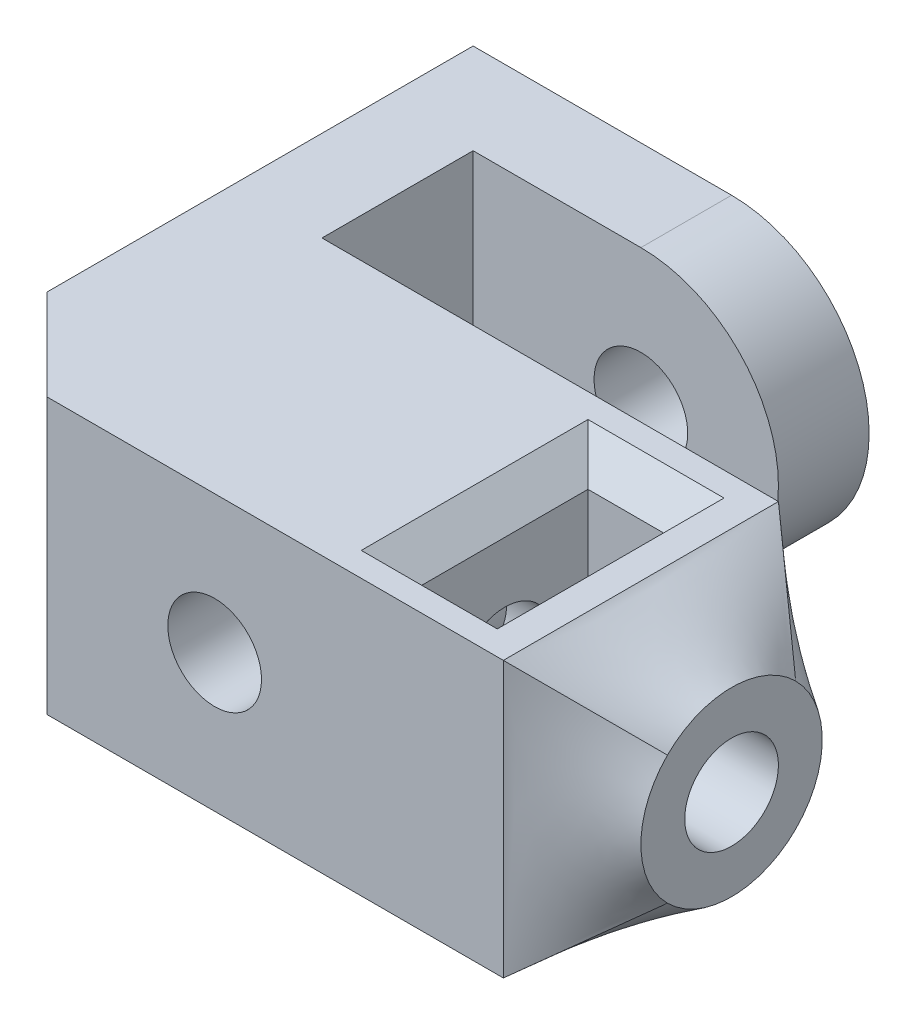
ISO-10303-21;
HEADER;
FILE_DESCRIPTION(('STEP AP214'),'2;1');
FILE_NAME('part.step','',(''),(''),'','','');
FILE_SCHEMA(('AUTOMOTIVE_DESIGN { 1 0 10303 214 1 1 1 1 }'));
ENDSEC;
DATA;
#1=APPLICATION_CONTEXT('core data for automotive mechanical design processes');
#2=APPLICATION_PROTOCOL_DEFINITION('international standard','automotive_design',2000,#1);
#3=PRODUCT_CONTEXT('',#1,'mechanical');
#4=PRODUCT('Part','Part','',(#3));
#5=PRODUCT_RELATED_PRODUCT_CATEGORY('part','',(#4));
#6=PRODUCT_DEFINITION_FORMATION('','',#4);
#7=PRODUCT_DEFINITION_CONTEXT('part definition',#1,'design');
#8=PRODUCT_DEFINITION('design','',#6,#7);
#9=PRODUCT_DEFINITION_SHAPE('','',#8);
#10=(LENGTH_UNIT() NAMED_UNIT(*) SI_UNIT(.MILLI.,.METRE.));
#11=(NAMED_UNIT(*) PLANE_ANGLE_UNIT() SI_UNIT($,.RADIAN.));
#12=(NAMED_UNIT(*) SI_UNIT($,.STERADIAN.) SOLID_ANGLE_UNIT());
#13=UNCERTAINTY_MEASURE_WITH_UNIT(LENGTH_MEASURE(1.E-05),#10,'distance_accuracy_value','');
#14=(GEOMETRIC_REPRESENTATION_CONTEXT(3) GLOBAL_UNCERTAINTY_ASSIGNED_CONTEXT((#13)) GLOBAL_UNIT_ASSIGNED_CONTEXT((#10,
#11,#12)) REPRESENTATION_CONTEXT('',''));
#15=CARTESIAN_POINT('',(0.,0.,0.));
#16=DIRECTION('',(0.,0.,1.));
#17=DIRECTION('',(1.,0.,0.));
#18=AXIS2_PLACEMENT_3D('',#15,#16,#17);
#19=CARTESIAN_POINT('',(-107.11518965689,2.50000000001586,4.55));
#20=DIRECTION('',(1.,0.,0.));
#21=DIRECTION('',(0.,0.,-1.));
#22=AXIS2_PLACEMENT_3D('',#19,#20,#21);
#23=CYLINDRICAL_SURFACE('',#22,1.55);
#24=CARTESIAN_POINT('',(-82.0141896568897,2.50000000001586,4.55));
#25=DIRECTION('',(1.,0.,0.));
#26=DIRECTION('',(0.,0.,-1.));
#27=AXIS2_PLACEMENT_3D('',#24,#25,#26);
#28=CIRCLE('',#27,1.55);
#29=CARTESIAN_POINT('',(-82.0141896568897,2.50000000001586,3.));
#30=VERTEX_POINT('',#29);
#31=EDGE_CURVE('E213',#30,#30,#28,.T.);
#32=ORIENTED_EDGE('',*,*,#31,.T.);
#33=EDGE_LOOP('',(#32));
#34=FACE_BOUND('',#33,.T.);
#35=CARTESIAN_POINT('',(-87.0141896568897,2.50000000001586,4.55));
#36=DIRECTION('',(-1.,0.,0.));
#37=DIRECTION('',(0.,0.,1.));
#38=AXIS2_PLACEMENT_3D('',#35,#36,#37);
#39=CIRCLE('',#38,1.55);
#40=CARTESIAN_POINT('',(-87.0141896568897,2.50000000001586,6.1));
#41=VERTEX_POINT('',#40);
#42=EDGE_CURVE('E290',#41,#41,#39,.T.);
#43=ORIENTED_EDGE('',*,*,#42,.T.);
#44=EDGE_LOOP('',(#43));
#45=FACE_BOUND('',#44,.T.);
#46=ADVANCED_FACE('F65',(#34,#45),#23,.F.);
#47=CARTESIAN_POINT('',(-100.11418965689,0.,0.));
#48=DIRECTION('',(-1.,0.,0.));
#49=DIRECTION('',(0.,0.,1.));
#50=AXIS2_PLACEMENT_3D('',#47,#48,#49);
#51=PLANE('',#50);
#52=DIRECTION('',(0.,1.,0.));
#53=VECTOR('',#52,1.);
#54=CARTESIAN_POINT('',(-100.11418965689,0.,-5.));
#55=LINE('',#54,#53);
#56=CARTESIAN_POINT('',(-100.11418965689,-2.04999999998414,-5.));
#57=VERTEX_POINT('',#56);
#58=CARTESIAN_POINT('',(-100.11418965689,7.05000000001586,-5.));
#59=VERTEX_POINT('',#58);
#60=EDGE_CURVE('E591',#57,#59,#55,.T.);
#61=ORIENTED_EDGE('',*,*,#60,.T.);
#62=DIRECTION('',(0.,0.,-1.));
#63=VECTOR('',#62,1.);
#64=CARTESIAN_POINT('',(-100.11418965689,7.05000000001586,-8.));
#65=LINE('',#64,#63);
#66=CARTESIAN_POINT('',(-100.11418965689,7.05000000001586,0.));
#67=VERTEX_POINT('',#66);
#68=EDGE_CURVE('E357',#67,#59,#65,.T.);
#69=ORIENTED_EDGE('',*,*,#68,.F.);
#70=DIRECTION('',(0.,-1.,0.));
#71=VECTOR('',#70,1.);
#72=CARTESIAN_POINT('',(-100.11418965689,0.,0.));
#73=LINE('',#72,#71);
#74=CARTESIAN_POINT('',(-100.11418965689,-2.04999999998414,0.));
#75=VERTEX_POINT('',#74);
#76=EDGE_CURVE('E545',#67,#75,#73,.T.);
#77=ORIENTED_EDGE('',*,*,#76,.T.);
#78=DIRECTION('',(0.,0.,1.));
#79=VECTOR('',#78,1.);
#80=CARTESIAN_POINT('',(-100.11418965689,-2.04999999998414,-8.));
#81=LINE('',#80,#79);
#82=EDGE_CURVE('E354',#57,#75,#81,.T.);
#83=ORIENTED_EDGE('',*,*,#82,.F.);
#84=EDGE_LOOP('',(#61,#69,#77,#83));
#85=FACE_BOUND('',#84,.T.);
#86=ADVANCED_FACE('F262',(#85),#51,.F.);
#87=CARTESIAN_POINT('',(0.,7.05000000001583,9.1));
#88=DIRECTION('',(0.,1.,0.));
#89=DIRECTION('',(-1.,0.,0.));
#90=AXIS2_PLACEMENT_3D('',#87,#88,#89);
#91=PLANE('',#90);
#92=DIRECTION('',(0.,0.,-1.));
#93=VECTOR('',#92,1.);
#94=CARTESIAN_POINT('',(-90.5141896568897,7.05000000001586,1.79999999999998));
#95=LINE('',#94,#93);
#96=CARTESIAN_POINT('',(-90.5141896568897,7.05000000001586,8.30000000000002));
#97=VERTEX_POINT('',#96);
#98=CARTESIAN_POINT('',(-90.5141896568897,7.05000000001586,0.799999999999976));
#99=VERTEX_POINT('',#98);
#100=EDGE_CURVE('E369',#97,#99,#95,.T.);
#101=ORIENTED_EDGE('',*,*,#100,.T.);
#102=DIRECTION('',(1.,0.,0.));
#103=VECTOR('',#102,1.);
#104=CARTESIAN_POINT('',(0.,7.05000000001583,0.799999999999976));
#105=LINE('',#104,#103);
#106=CARTESIAN_POINT('',(-86.0141896568897,7.05000000001586,0.799999999999976));
#107=VERTEX_POINT('',#106);
#108=EDGE_CURVE('E314',#99,#107,#105,.T.);
#109=ORIENTED_EDGE('',*,*,#108,.T.);
#110=DIRECTION('',(0.,0.,1.));
#111=VECTOR('',#110,1.);
#112=CARTESIAN_POINT('',(-86.0141896568897,7.05000000001586,9.1));
#113=LINE('',#112,#111);
#114=CARTESIAN_POINT('',(-86.0141896568897,7.05000000001586,8.30000000000002));
#115=VERTEX_POINT('',#114);
#116=EDGE_CURVE('E382',#107,#115,#113,.T.);
#117=ORIENTED_EDGE('',*,*,#116,.T.);
#118=DIRECTION('',(-1.,0.,0.));
#119=VECTOR('',#118,1.);
#120=CARTESIAN_POINT('',(0.,7.05000000001583,8.30000000000002));
#121=LINE('',#120,#119);
#122=EDGE_CURVE('E380',#115,#97,#121,.T.);
#123=ORIENTED_EDGE('',*,*,#122,.T.);
#124=EDGE_LOOP('',(#101,#109,#117,#123));
#125=FACE_BOUND('',#124,.T.);
#126=DIRECTION('',(0.,0.,-1.));
#127=VECTOR('',#126,1.);
#128=CARTESIAN_POINT('',(-103.11418965689,7.05000000001586,-8.));
#129=LINE('',#128,#127);
#130=CARTESIAN_POINT('',(-103.11418965689,7.05000000001586,6.09999999999998));
#131=VERTEX_POINT('',#130);
#132=CARTESIAN_POINT('',(-103.11418965689,7.05000000001586,-8.));
#133=VERTEX_POINT('',#132);
#134=EDGE_CURVE('E335',#131,#133,#129,.T.);
#135=ORIENTED_EDGE('',*,*,#134,.F.);
#136=DIRECTION('',(-0.707106781186548,0.,-0.707106781186547));
#137=VECTOR('',#136,1.);
#138=CARTESIAN_POINT('',(-50.0570948284447,7.05000000001585,59.1570948284448));
#139=LINE('',#138,#137);
#140=CARTESIAN_POINT('',(-100.11418965689,7.05000000001587,9.1));
#141=VERTEX_POINT('',#140);
#142=EDGE_CURVE('E87',#131,#141,#139,.F.);
#143=ORIENTED_EDGE('',*,*,#142,.T.);
#144=DIRECTION('',(1.,0.,0.));
#145=VECTOR('',#144,1.);
#146=CARTESIAN_POINT('',(0.,7.05000000001583,9.1));
#147=LINE('',#146,#145);
#148=CARTESIAN_POINT('',(-85.0141896568897,7.05000000001586,9.1));
#149=VERTEX_POINT('',#148);
#150=EDGE_CURVE('E361',#141,#149,#147,.T.);
#151=ORIENTED_EDGE('',*,*,#150,.T.);
#152=DIRECTION('',(0.,0.,1.));
#153=VECTOR('',#152,1.);
#154=CARTESIAN_POINT('',(-85.0141896568897,7.05000000001586,9.1));
#155=LINE('',#154,#153);
#156=CARTESIAN_POINT('',(-85.0141896568897,7.05000000001586,0.));
#157=VERTEX_POINT('',#156);
#158=EDGE_CURVE('E370',#149,#157,#155,.F.);
#159=ORIENTED_EDGE('',*,*,#158,.T.);
#160=DIRECTION('',(1.,0.,0.));
#161=VECTOR('',#160,1.);
#162=CARTESIAN_POINT('',(0.,7.05000000001583,0.));
#163=LINE('',#162,#161);
#164=EDGE_CURVE('E550',#67,#157,#163,.T.);
#165=ORIENTED_EDGE('',*,*,#164,.F.);
#166=ORIENTED_EDGE('',*,*,#68,.T.);
#167=DIRECTION('',(1.,0.,0.));
#168=VECTOR('',#167,1.);
#169=CARTESIAN_POINT('',(0.,7.05000000001586,-5.));
#170=LINE('',#169,#168);
#171=CARTESIAN_POINT('',(-94.5641896568897,7.05000000001586,-5.));
#172=VERTEX_POINT('',#171);
#173=EDGE_CURVE('E584',#59,#172,#170,.T.);
#174=ORIENTED_EDGE('',*,*,#173,.T.);
#175=DIRECTION('',(0.,0.,1.));
#176=VECTOR('',#175,1.);
#177=CARTESIAN_POINT('',(-94.5641896568897,7.05000000001586,-8.));
#178=LINE('',#177,#176);
#179=CARTESIAN_POINT('',(-94.5641896568897,7.05000000001586,-8.));
#180=VERTEX_POINT('',#179);
#181=EDGE_CURVE('E358',#180,#172,#178,.T.);
#182=ORIENTED_EDGE('',*,*,#181,.F.);
#183=DIRECTION('',(1.,0.,0.));
#184=VECTOR('',#183,1.);
#185=CARTESIAN_POINT('',(-103.11418965689,7.05000000001586,-8.));
#186=LINE('',#185,#184);
#187=EDGE_CURVE('E341',#133,#180,#186,.T.);
#188=ORIENTED_EDGE('',*,*,#187,.F.);
#189=EDGE_LOOP('',(#135,#143,#151,#159,#165,#166,#174,#182,#188));
#190=FACE_BOUND('',#189,.T.);
#191=ADVANCED_FACE('F267',(#125,#190),#91,.T.);
#192=CARTESIAN_POINT('',(0.,-2.04999999998411,9.1));
#193=DIRECTION('',(0.,1.,0.));
#194=DIRECTION('',(-1.,0.,0.));
#195=AXIS2_PLACEMENT_3D('',#192,#193,#194);
#196=PLANE('',#195);
#197=DIRECTION('',(1.,0.,0.));
#198=VECTOR('',#197,1.);
#199=CARTESIAN_POINT('',(0.,-2.04999999998411,9.1));
#200=LINE('',#199,#198);
#201=CARTESIAN_POINT('',(-100.11418965689,-2.04999999998414,9.1));
#202=VERTEX_POINT('',#201);
#203=CARTESIAN_POINT('',(-85.0141896568897,-2.04999999998414,9.1));
#204=VERTEX_POINT('',#203);
#205=EDGE_CURVE('E363',#202,#204,#200,.T.);
#206=ORIENTED_EDGE('',*,*,#205,.F.);
#207=DIRECTION('',(0.707106781186548,0.,0.707106781186547));
#208=VECTOR('',#207,1.);
#209=CARTESIAN_POINT('',(-103.11418965689,-2.04999999998414,6.09999999999999));
#210=LINE('',#209,#208);
#211=CARTESIAN_POINT('',(-103.11418965689,-2.04999999998414,6.09999999999999));
#212=VERTEX_POINT('',#211);
#213=EDGE_CURVE('E13',#202,#212,#210,.F.);
#214=ORIENTED_EDGE('',*,*,#213,.T.);
#215=DIRECTION('',(0.,0.,1.));
#216=VECTOR('',#215,1.);
#217=CARTESIAN_POINT('',(-103.11418965689,-2.04999999998414,-8.));
#218=LINE('',#217,#216);
#219=CARTESIAN_POINT('',(-103.11418965689,-2.04999999998414,-8.));
#220=VERTEX_POINT('',#219);
#221=EDGE_CURVE('E337',#220,#212,#218,.T.);
#222=ORIENTED_EDGE('',*,*,#221,.F.);
#223=DIRECTION('',(1.,0.,0.));
#224=VECTOR('',#223,1.);
#225=CARTESIAN_POINT('',(-103.11418965689,-2.04999999998414,-8.));
#226=LINE('',#225,#224);
#227=CARTESIAN_POINT('',(-94.5641896568897,-2.04999999998414,-8.));
#228=VERTEX_POINT('',#227);
#229=EDGE_CURVE('E344',#220,#228,#226,.T.);
#230=ORIENTED_EDGE('',*,*,#229,.T.);
#231=DIRECTION('',(0.,0.,1.));
#232=VECTOR('',#231,1.);
#233=CARTESIAN_POINT('',(-94.5641896568897,-2.04999999998414,-8.));
#234=LINE('',#233,#232);
#235=CARTESIAN_POINT('',(-94.5641896568897,-2.04999999998414,-5.));
#236=VERTEX_POINT('',#235);
#237=EDGE_CURVE('E583',#228,#236,#234,.T.);
#238=ORIENTED_EDGE('',*,*,#237,.T.);
#239=DIRECTION('',(-1.,0.,0.));
#240=VECTOR('',#239,1.);
#241=CARTESIAN_POINT('',(0.,-2.04999999998414,-5.));
#242=LINE('',#241,#240);
#243=EDGE_CURVE('E589',#236,#57,#242,.T.);
#244=ORIENTED_EDGE('',*,*,#243,.T.);
#245=ORIENTED_EDGE('',*,*,#82,.T.);
#246=DIRECTION('',(1.,0.,0.));
#247=VECTOR('',#246,1.);
#248=CARTESIAN_POINT('',(0.,-2.04999999998411,0.));
#249=LINE('',#248,#247);
#250=CARTESIAN_POINT('',(-85.0141896568897,-2.04999999998414,0.));
#251=VERTEX_POINT('',#250);
#252=EDGE_CURVE('E373',#75,#251,#249,.T.);
#253=ORIENTED_EDGE('',*,*,#252,.T.);
#254=DIRECTION('',(0.,0.,1.));
#255=VECTOR('',#254,1.);
#256=CARTESIAN_POINT('',(-85.0141896568897,-2.04999999998414,9.1));
#257=LINE('',#256,#255);
#258=EDGE_CURVE('E367',#204,#251,#257,.F.);
#259=ORIENTED_EDGE('',*,*,#258,.F.);
#260=EDGE_LOOP('',(#206,#214,#222,#230,#238,#244,#245,#253,#259));
#261=FACE_BOUND('',#260,.T.);
#262=ADVANCED_FACE('F408',(#261),#196,.F.);
#263=CARTESIAN_POINT('',(-94.5641896568897,2.50000000001586,9.1));
#264=DIRECTION('',(0.,0.,-1.));
#265=DIRECTION('',(-1.,0.,0.));
#266=AXIS2_PLACEMENT_3D('',#263,#264,#265);
#267=CYLINDRICAL_SURFACE('',#266,1.54999999999998);
#268=CARTESIAN_POINT('',(-94.5641896568897,2.50000000001586,9.1));
#269=DIRECTION('',(0.,0.,1.));
#270=DIRECTION('',(1.,0.,0.));
#271=AXIS2_PLACEMENT_3D('',#268,#269,#270);
#272=CIRCLE('',#271,1.54999999999998);
#273=CARTESIAN_POINT('',(-93.0141896568897,2.50000000001586,9.1));
#274=VERTEX_POINT('',#273);
#275=EDGE_CURVE('E376',#274,#274,#272,.T.);
#276=ORIENTED_EDGE('',*,*,#275,.T.);
#277=EDGE_LOOP('',(#276));
#278=FACE_BOUND('',#277,.T.);
#279=CARTESIAN_POINT('',(-94.5641896568897,2.50000000001586,0.));
#280=DIRECTION('',(0.,0.,1.));
#281=DIRECTION('',(1.,0.,0.));
#282=AXIS2_PLACEMENT_3D('',#279,#280,#281);
#283=CIRCLE('',#282,1.54999999999998);
#284=CARTESIAN_POINT('',(-93.0141896568897,2.50000000001586,0.));
#285=VERTEX_POINT('',#284);
#286=EDGE_CURVE('E364',#285,#285,#283,.T.);
#287=ORIENTED_EDGE('',*,*,#286,.F.);
#288=EDGE_LOOP('',(#287));
#289=FACE_BOUND('',#288,.T.);
#290=ADVANCED_FACE('F411',(#278,#289),#267,.F.);
#291=CARTESIAN_POINT('',(0.,0.,9.1));
#292=DIRECTION('',(0.,0.,1.));
#293=DIRECTION('',(1.,0.,0.));
#294=AXIS2_PLACEMENT_3D('',#291,#292,#293);
#295=PLANE('',#294);
#296=ORIENTED_EDGE('',*,*,#150,.F.);
#297=DIRECTION('',(0.,-1.,0.));
#298=VECTOR('',#297,1.);
#299=CARTESIAN_POINT('',(-100.11418965689,0.,9.1));
#300=LINE('',#299,#298);
#301=EDGE_CURVE('E73',#141,#202,#300,.T.);
#302=ORIENTED_EDGE('',*,*,#301,.T.);
#303=ORIENTED_EDGE('',*,*,#205,.T.);
#304=DIRECTION('',(0.,1.,0.));
#305=VECTOR('',#304,1.);
#306=CARTESIAN_POINT('',(-85.0141896568897,0.,9.1));
#307=LINE('',#306,#305);
#308=EDGE_CURVE('E366',#204,#149,#307,.T.);
#309=ORIENTED_EDGE('',*,*,#308,.T.);
#310=EDGE_LOOP('',(#296,#302,#303,#309));
#311=FACE_BOUND('',#310,.T.);
#312=ORIENTED_EDGE('',*,*,#275,.F.);
#313=EDGE_LOOP('',(#312));
#314=FACE_BOUND('',#313,.T.);
#315=ADVANCED_FACE('F415',(#311,#314),#295,.T.);
#316=CARTESIAN_POINT('',(0.,0.,0.));
#317=DIRECTION('',(0.,0.,1.));
#318=DIRECTION('',(1.,0.,0.));
#319=AXIS2_PLACEMENT_3D('',#316,#317,#318);
#320=PLANE('',#319);
#321=ORIENTED_EDGE('',*,*,#164,.T.);
#322=DIRECTION('',(0.,1.,0.));
#323=VECTOR('',#322,1.);
#324=CARTESIAN_POINT('',(-85.0141896568897,0.,0.));
#325=LINE('',#324,#323);
#326=EDGE_CURVE('E371',#251,#157,#325,.T.);
#327=ORIENTED_EDGE('',*,*,#326,.F.);
#328=ORIENTED_EDGE('',*,*,#252,.F.);
#329=ORIENTED_EDGE('',*,*,#76,.F.);
#330=EDGE_LOOP('',(#321,#327,#328,#329));
#331=FACE_BOUND('',#330,.T.);
#332=ORIENTED_EDGE('',*,*,#286,.T.);
#333=EDGE_LOOP('',(#332));
#334=FACE_BOUND('',#333,.T.);
#335=ADVANCED_FACE('F417',(#331,#334),#320,.F.);
#336=CARTESIAN_POINT('',(-103.11418965689,7.05000000001586,-8.));
#337=DIRECTION('',(0.,0.,1.));
#338=DIRECTION('',(0.,-1.,0.));
#339=AXIS2_PLACEMENT_3D('',#336,#337,#338);
#340=PLANE('',#339);
#341=ORIENTED_EDGE('',*,*,#187,.T.);
#342=CARTESIAN_POINT('',(-94.5641896568897,2.50000000001586,-8.));
#343=DIRECTION('',(0.,0.,-1.));
#344=DIRECTION('',(-1.,0.,0.));
#345=AXIS2_PLACEMENT_3D('',#342,#343,#344);
#346=CIRCLE('',#345,4.55);
#347=EDGE_CURVE('E571',#180,#228,#346,.T.);
#348=ORIENTED_EDGE('',*,*,#347,.T.);
#349=ORIENTED_EDGE('',*,*,#229,.F.);
#350=DIRECTION('',(0.,-1.,0.));
#351=VECTOR('',#350,1.);
#352=CARTESIAN_POINT('',(-103.11418965689,7.05000000001586,-8.));
#353=LINE('',#352,#351);
#354=EDGE_CURVE('E346',#133,#220,#353,.T.);
#355=ORIENTED_EDGE('',*,*,#354,.F.);
#356=EDGE_LOOP('',(#341,#348,#349,#355));
#357=FACE_BOUND('',#356,.T.);
#358=CARTESIAN_POINT('',(-94.5641896568897,2.50000000001586,-8.));
#359=DIRECTION('',(0.,0.,-1.));
#360=DIRECTION('',(-1.,0.,0.));
#361=AXIS2_PLACEMENT_3D('',#358,#359,#360);
#362=CIRCLE('',#361,1.54999999999998);
#363=CARTESIAN_POINT('',(-96.1141896568897,2.50000000001586,-8.));
#364=VERTEX_POINT('',#363);
#365=EDGE_CURVE('E579',#364,#364,#362,.T.);
#366=ORIENTED_EDGE('',*,*,#365,.F.);
#367=EDGE_LOOP('',(#366));
#368=FACE_BOUND('',#367,.T.);
#369=ADVANCED_FACE('F420',(#357,#368),#340,.F.);
#370=CARTESIAN_POINT('',(-103.11418965689,0.,0.));
#371=DIRECTION('',(-1.,0.,0.));
#372=DIRECTION('',(0.,0.,1.));
#373=AXIS2_PLACEMENT_3D('',#370,#371,#372);
#374=PLANE('',#373);
#375=ORIENTED_EDGE('',*,*,#221,.T.);
#376=DIRECTION('',(0.,1.,0.));
#377=VECTOR('',#376,1.);
#378=CARTESIAN_POINT('',(-103.11418965689,0.,6.09999999999999));
#379=LINE('',#378,#377);
#380=EDGE_CURVE('E319',#212,#131,#379,.T.);
#381=ORIENTED_EDGE('',*,*,#380,.T.);
#382=ORIENTED_EDGE('',*,*,#134,.T.);
#383=ORIENTED_EDGE('',*,*,#354,.T.);
#384=EDGE_LOOP('',(#375,#381,#382,#383));
#385=FACE_BOUND('',#384,.T.);
#386=ADVANCED_FACE('F333',(#385),#374,.T.);
#387=CARTESIAN_POINT('',(-94.5641896568897,2.50000000001586,-8.));
#388=DIRECTION('',(0.,0.,1.));
#389=DIRECTION('',(1.,0.,0.));
#390=AXIS2_PLACEMENT_3D('',#387,#388,#389);
#391=CYLINDRICAL_SURFACE('',#390,4.55);
#392=CARTESIAN_POINT('',(-94.5641896568897,2.50000000001586,-5.));
#393=DIRECTION('',(0.,0.,-1.));
#394=DIRECTION('',(-1.,0.,0.));
#395=AXIS2_PLACEMENT_3D('',#392,#393,#394);
#396=CIRCLE('',#395,4.55);
#397=EDGE_CURVE('E587',#172,#236,#396,.T.);
#398=ORIENTED_EDGE('',*,*,#397,.T.);
#399=ORIENTED_EDGE('',*,*,#237,.F.);
#400=ORIENTED_EDGE('',*,*,#347,.F.);
#401=ORIENTED_EDGE('',*,*,#181,.T.);
#402=EDGE_LOOP('',(#398,#399,#400,#401));
#403=FACE_BOUND('',#402,.T.);
#404=ADVANCED_FACE('F429',(#403),#391,.T.);
#405=CARTESIAN_POINT('',(-94.5641896568897,2.50000000001586,-8.));
#406=DIRECTION('',(0.,0.,1.));
#407=DIRECTION('',(1.,0.,0.));
#408=AXIS2_PLACEMENT_3D('',#405,#406,#407);
#409=CYLINDRICAL_SURFACE('',#408,1.54999999999998);
#410=ORIENTED_EDGE('',*,*,#365,.T.);
#411=EDGE_LOOP('',(#410));
#412=FACE_BOUND('',#411,.T.);
#413=CARTESIAN_POINT('',(-94.5641896568897,2.50000000001586,-5.));
#414=DIRECTION('',(0.,0.,-1.));
#415=DIRECTION('',(-1.,0.,0.));
#416=AXIS2_PLACEMENT_3D('',#413,#414,#415);
#417=CIRCLE('',#416,1.54999999999998);
#418=CARTESIAN_POINT('',(-96.1141896568897,2.50000000001586,-5.));
#419=VERTEX_POINT('',#418);
#420=EDGE_CURVE('E580',#419,#419,#417,.T.);
#421=ORIENTED_EDGE('',*,*,#420,.F.);
#422=EDGE_LOOP('',(#421));
#423=FACE_BOUND('',#422,.T.);
#424=ADVANCED_FACE('F432',(#412,#423),#409,.F.);
#425=CARTESIAN_POINT('',(0.,0.,-5.));
#426=DIRECTION('',(0.,0.,-1.));
#427=DIRECTION('',(-1.,0.,0.));
#428=AXIS2_PLACEMENT_3D('',#425,#426,#427);
#429=PLANE('',#428);
#430=ORIENTED_EDGE('',*,*,#173,.F.);
#431=ORIENTED_EDGE('',*,*,#60,.F.);
#432=ORIENTED_EDGE('',*,*,#243,.F.);
#433=ORIENTED_EDGE('',*,*,#397,.F.);
#434=EDGE_LOOP('',(#430,#431,#432,#433));
#435=FACE_BOUND('',#434,.T.);
#436=ORIENTED_EDGE('',*,*,#420,.T.);
#437=EDGE_LOOP('',(#436));
#438=FACE_BOUND('',#437,.T.);
#439=ADVANCED_FACE('F436',(#435,#438),#429,.F.);
#440=CARTESIAN_POINT('',(-82.0141896568897,2.50000000001586,4.55));
#441=DIRECTION('',(1.,0.,0.));
#442=DIRECTION('',(0.,0.,-1.));
#443=AXIS2_PLACEMENT_3D('',#440,#441,#442);
#444=PLANE('',#443);
#445=ORIENTED_EDGE('',*,*,#31,.F.);
#446=EDGE_LOOP('',(#445));
#447=FACE_BOUND('',#446,.T.);
#448=CARTESIAN_POINT('',(-82.0141896568897,2.50000000001586,4.55));
#449=DIRECTION('',(1.,0.,0.));
#450=DIRECTION('',(0.,0.,-1.));
#451=AXIS2_PLACEMENT_3D('',#448,#449,#450);
#452=CIRCLE('',#451,3.);
#453=CARTESIAN_POINT('',(-82.0141896568897,0.378679656456218,2.42867965644036));
#454=VERTEX_POINT('',#453);
#455=CARTESIAN_POINT('',(-82.0141896568897,4.6213203435755,2.42867965644036));
#456=VERTEX_POINT('',#455);
#457=EDGE_CURVE('E475',#454,#456,#452,.T.);
#458=ORIENTED_EDGE('',*,*,#457,.T.);
#459=CARTESIAN_POINT('',(-82.0141896568897,4.6213203435755,6.67132034355964));
#460=VERTEX_POINT('',#459);
#461=EDGE_CURVE('E553',#456,#460,#452,.T.);
#462=ORIENTED_EDGE('',*,*,#461,.T.);
#463=CARTESIAN_POINT('',(-82.0141896568897,0.378679656456219,6.67132034355964));
#464=VERTEX_POINT('',#463);
#465=EDGE_CURVE('E557',#460,#464,#452,.T.);
#466=ORIENTED_EDGE('',*,*,#465,.T.);
#467=EDGE_CURVE('E521',#464,#454,#452,.T.);
#468=ORIENTED_EDGE('',*,*,#467,.T.);
#469=EDGE_LOOP('',(#458,#462,#466,#468));
#470=FACE_BOUND('',#469,.T.);
#471=ADVANCED_FACE('F440',(#447,#470),#444,.T.);
#472=CARTESIAN_POINT('',(-85.0141896568897,-2.04999999998414,9.1));
#473=CARTESIAN_POINT('',(-82.0141896568897,0.378679656456219,6.67132034355964));
#474=CARTESIAN_POINT('',(-85.0141896568897,-2.04999999998414,8.34166666666667));
#475=CARTESIAN_POINT('',(-82.0141896568897,0.128679656456219,6.42132034355964));
#476=CARTESIAN_POINT('',(-85.0141896568897,-2.04999999998414,7.58333333333334));
#477=CARTESIAN_POINT('',(-82.0141896568897,-0.0954757886155108,6.10603832728978));
#478=CARTESIAN_POINT('',(-85.0141896568897,-2.04999999998414,6.06666666666667));
#479=CARTESIAN_POINT('',(-82.0141896568897,-0.410975479348306,5.37702575770465));
#480=CARTESIAN_POINT('',(-85.0141896568897,-2.04999999998414,5.30833333333334));
#481=CARTESIAN_POINT('',(-82.0141896568897,-0.499999999984139,4.9642135623731));
#482=CARTESIAN_POINT('',(-85.0141896568897,-2.04999999998414,3.79166666666667));
#483=CARTESIAN_POINT('',(-82.0141896568897,-0.49999999998414,4.13578643762691));
#484=CARTESIAN_POINT('',(-85.0141896568897,-2.04999999998414,3.03333333333334));
#485=CARTESIAN_POINT('',(-82.0141896568897,-0.410975479348307,3.72297424229535));
#486=CARTESIAN_POINT('',(-85.0141896568897,-2.04999999998414,1.51666666666667));
#487=CARTESIAN_POINT('',(-82.0141896568897,-0.095475788615512,2.99396167271023));
#488=CARTESIAN_POINT('',(-85.0141896568897,-2.04999999998414,0.758333333333336));
#489=CARTESIAN_POINT('',(-82.0141896568897,0.128679656456218,2.67867965644036));
#490=CARTESIAN_POINT('',(-85.0141896568897,-2.04999999998414,0.));
#491=CARTESIAN_POINT('',(-82.0141896568897,0.378679656456218,2.42867965644036));
#492=B_SPLINE_SURFACE_WITH_KNOTS('',3,1,((#472,#473),(#474,#475),(#476,#477),(#478,#479),(#480,
#481),(#482,#483),(#484,#485),(#486,#487),(#488,#489),(#490,#491)),.UNSPECIFIED.,.F.,.F.,.F.,(4,
2,2,2,4),(2,2),(0.,0.25,0.5,0.75,1.),(0.,1.),.UNSPECIFIED.);
#493=DIRECTION('',(0.657841435116081,0.532562036876651,0.532562036876651));
#494=VECTOR('',#493,1.);
#495=CARTESIAN_POINT('',(-83.5141896568897,-0.835660171763959,1.21433982822018));
#496=LINE('',#495,#494);
#497=EDGE_CURVE('E534',#251,#454,#496,.T.);
#498=DIRECTION('',(-0.657841435116081,-0.532562036876651,0.532562036876651));
#499=VECTOR('',#498,1.);
#500=CARTESIAN_POINT('',(-83.5141896568897,-0.835660171763959,7.88566017177982));
#501=LINE('',#500,#499);
#502=EDGE_CURVE('E531',#464,#204,#501,.T.);
#503=ORIENTED_EDGE('',*,*,#258,.T.);
#504=ORIENTED_EDGE('',*,*,#497,.T.);
#505=ORIENTED_EDGE('',*,*,#467,.F.);
#506=ORIENTED_EDGE('',*,*,#502,.T.);
#507=EDGE_LOOP('',(#503,#504,#505,#506));
#508=FACE_BOUND('',#507,.T.);
#509=ADVANCED_FACE('F493',(#508),#492,.T.);
#510=CARTESIAN_POINT('',(-85.0141896568897,-2.04999999998414,0.));
#511=CARTESIAN_POINT('',(-82.0141896568897,0.378679656456218,2.42867965644036));
#512=CARTESIAN_POINT('',(-85.0141896568897,-1.2916666666508,0.));
#513=CARTESIAN_POINT('',(-82.0141896568897,0.628679656456218,2.17867965644036));
#514=CARTESIAN_POINT('',(-85.0141896568897,-0.533333333317469,0.));
#515=CARTESIAN_POINT('',(-82.0141896568897,0.943961672726088,1.95452421136863));
#516=CARTESIAN_POINT('',(-85.0141896568897,0.983333333349198,0.));
#517=CARTESIAN_POINT('',(-82.0141896568897,1.67297424231121,1.63902452063583));
#518=CARTESIAN_POINT('',(-85.0141896568897,1.74166666668253,0.));
#519=CARTESIAN_POINT('',(-82.0141896568897,2.08578643764277,1.55));
#520=CARTESIAN_POINT('',(-85.0141896568897,3.2583333333492,0.));
#521=CARTESIAN_POINT('',(-82.0141896568897,2.91421356238896,1.55));
#522=CARTESIAN_POINT('',(-85.0141896568897,4.01666666668253,0.));
#523=CARTESIAN_POINT('',(-82.0141896568897,3.32702575772051,1.63902452063583));
#524=CARTESIAN_POINT('',(-85.0141896568897,5.5333333333492,0.));
#525=CARTESIAN_POINT('',(-82.0141896568898,4.05603832730563,1.95452421136863));
#526=CARTESIAN_POINT('',(-85.0141896568897,6.29166666668253,0.));
#527=CARTESIAN_POINT('',(-82.0141896568897,4.3713203435755,2.17867965644036));
#528=CARTESIAN_POINT('',(-85.0141896568897,7.05000000001586,0.));
#529=CARTESIAN_POINT('',(-82.0141896568897,4.6213203435755,2.42867965644036));
#530=B_SPLINE_SURFACE_WITH_KNOTS('',3,1,((#510,#511),(#512,#513),(#514,#515),(#516,#517),(#518,
#519),(#520,#521),(#522,#523),(#524,#525),(#526,#527),(#528,#529)),.UNSPECIFIED.,.F.,.F.,.F.,(4,
2,2,2,4),(2,2),(0.,0.25,0.5,0.75,1.),(0.,1.),.UNSPECIFIED.);
#531=DIRECTION('',(0.657841435116081,-0.532562036876651,0.532562036876651));
#532=VECTOR('',#531,1.);
#533=CARTESIAN_POINT('',(-83.5141896568897,5.83566017179568,1.21433982822018));
#534=LINE('',#533,#532);
#535=EDGE_CURVE('E527',#157,#456,#534,.T.);
#536=ORIENTED_EDGE('',*,*,#326,.T.);
#537=ORIENTED_EDGE('',*,*,#535,.T.);
#538=ORIENTED_EDGE('',*,*,#457,.F.);
#539=ORIENTED_EDGE('',*,*,#497,.F.);
#540=EDGE_LOOP('',(#536,#537,#538,#539));
#541=FACE_BOUND('',#540,.T.);
#542=ADVANCED_FACE('F482',(#541),#530,.T.);
#543=CARTESIAN_POINT('',(-85.0141896568897,7.05000000001586,9.1));
#544=CARTESIAN_POINT('',(-82.0141896568897,4.6213203435755,6.67132034355964));
#545=CARTESIAN_POINT('',(-85.0141896568897,6.29166666668253,9.1));
#546=CARTESIAN_POINT('',(-82.0141896568897,4.3713203435755,6.92132034355964));
#547=CARTESIAN_POINT('',(-85.0141896568897,5.5333333333492,9.1));
#548=CARTESIAN_POINT('',(-82.0141896568897,4.05603832730563,7.14547578863137));
#549=CARTESIAN_POINT('',(-85.0141896568897,4.01666666668253,9.1));
#550=CARTESIAN_POINT('',(-82.0141896568897,3.32702575772051,7.46097547936417));
#551=CARTESIAN_POINT('',(-85.0141896568897,3.2583333333492,9.1));
#552=CARTESIAN_POINT('',(-82.0141896568897,2.91421356238896,7.55));
#553=CARTESIAN_POINT('',(-85.0141896568897,1.74166666668253,9.1));
#554=CARTESIAN_POINT('',(-82.0141896568897,2.08578643764277,7.55));
#555=CARTESIAN_POINT('',(-85.0141896568897,0.983333333349201,9.1));
#556=CARTESIAN_POINT('',(-82.0141896568897,1.67297424231121,7.46097547936417));
#557=CARTESIAN_POINT('',(-85.0141896568897,-0.533333333317467,9.1));
#558=CARTESIAN_POINT('',(-82.0141896568897,0.943961672726089,7.14547578863137));
#559=CARTESIAN_POINT('',(-85.0141896568897,-1.2916666666508,9.1));
#560=CARTESIAN_POINT('',(-82.0141896568897,0.628679656456219,6.92132034355964));
#561=CARTESIAN_POINT('',(-85.0141896568897,-2.04999999998414,9.1));
#562=CARTESIAN_POINT('',(-82.0141896568897,0.378679656456219,6.67132034355964));
#563=B_SPLINE_SURFACE_WITH_KNOTS('',3,1,((#543,#544),(#545,#546),(#547,#548),(#549,#550),(#551,
#552),(#553,#554),(#555,#556),(#557,#558),(#559,#560),(#561,#562)),.UNSPECIFIED.,.F.,.F.,.F.,(4,
2,2,2,4),(2,2),(0.,0.25,0.5,0.75,1.),(0.,1.),.UNSPECIFIED.);
#564=DIRECTION('',(0.657841435116081,-0.532562036876651,-0.532562036876651));
#565=VECTOR('',#564,1.);
#566=CARTESIAN_POINT('',(-83.5141896568897,5.83566017179568,7.88566017177982));
#567=LINE('',#566,#565);
#568=EDGE_CURVE('E228',#149,#460,#567,.T.);
#569=ORIENTED_EDGE('',*,*,#308,.F.);
#570=ORIENTED_EDGE('',*,*,#502,.F.);
#571=ORIENTED_EDGE('',*,*,#465,.F.);
#572=ORIENTED_EDGE('',*,*,#568,.F.);
#573=EDGE_LOOP('',(#569,#570,#571,#572));
#574=FACE_BOUND('',#573,.T.);
#575=ADVANCED_FACE('F447',(#574),#563,.T.);
#576=CARTESIAN_POINT('',(-85.0141896568897,7.05000000001586,0.));
#577=CARTESIAN_POINT('',(-82.0141896568897,4.6213203435755,2.42867965644036));
#578=CARTESIAN_POINT('',(-85.0141896568897,7.05000000001586,0.758333333333333));
#579=CARTESIAN_POINT('',(-82.0141896568897,4.8713203435755,2.67867965644036));
#580=CARTESIAN_POINT('',(-85.0141896568897,7.05000000001586,1.51666666666667));
#581=CARTESIAN_POINT('',(-82.0141896568897,5.09547578864724,2.99396167271023));
#582=CARTESIAN_POINT('',(-85.0141896568897,7.05000000001586,3.03333333333333));
#583=CARTESIAN_POINT('',(-82.0141896568897,5.41097547938003,3.72297424229535));
#584=CARTESIAN_POINT('',(-85.0141896568897,7.05000000001586,3.79166666666667));
#585=CARTESIAN_POINT('',(-82.0141896568897,5.50000000001586,4.13578643762691));
#586=CARTESIAN_POINT('',(-85.0141896568897,7.05000000001586,5.30833333333333));
#587=CARTESIAN_POINT('',(-82.0141896568897,5.50000000001586,4.9642135623731));
#588=CARTESIAN_POINT('',(-85.0141896568897,7.05000000001586,6.06666666666667));
#589=CARTESIAN_POINT('',(-82.0141896568897,5.41097547938003,5.37702575770466));
#590=CARTESIAN_POINT('',(-85.0141896568897,7.05000000001586,7.58333333333333));
#591=CARTESIAN_POINT('',(-82.0141896568897,5.09547578864724,6.10603832728978));
#592=CARTESIAN_POINT('',(-85.0141896568897,7.05000000001586,8.34166666666667));
#593=CARTESIAN_POINT('',(-82.0141896568897,4.8713203435755,6.42132034355964));
#594=CARTESIAN_POINT('',(-85.0141896568897,7.05000000001586,9.1));
#595=CARTESIAN_POINT('',(-82.0141896568897,4.6213203435755,6.67132034355964));
#596=B_SPLINE_SURFACE_WITH_KNOTS('',3,1,((#576,#577),(#578,#579),(#580,#581),(#582,#583),(#584,
#585),(#586,#587),(#588,#589),(#590,#591),(#592,#593),(#594,#595)),.UNSPECIFIED.,.F.,.F.,.F.,(4,
2,2,2,4),(2,2),(0.,0.25,0.5,0.75,1.),(0.,1.),.UNSPECIFIED.);
#597=ORIENTED_EDGE('',*,*,#158,.F.);
#598=ORIENTED_EDGE('',*,*,#568,.T.);
#599=ORIENTED_EDGE('',*,*,#461,.F.);
#600=ORIENTED_EDGE('',*,*,#535,.F.);
#601=EDGE_LOOP('',(#597,#598,#599,#600));
#602=FACE_BOUND('',#601,.T.);
#603=ADVANCED_FACE('F242',(#602),#596,.T.);
#604=CARTESIAN_POINT('',(-89.5141896568897,1.46363793321427,0.845031754737406));
#605=DIRECTION('',(0.,0.866025403784439,0.5));
#606=DIRECTION('',(0.,-0.5,0.866025403784439));
#607=AXIS2_PLACEMENT_3D('',#604,#605,#606);
#608=PLANE('',#607);
#609=DIRECTION('',(0.,-0.5,0.866025403784439));
#610=VECTOR('',#609,1.);
#611=CARTESIAN_POINT('',(-87.0141896568897,1.46363793321427,0.845031754737406));
#612=LINE('',#611,#610);
#613=CARTESIAN_POINT('',(-87.0141896568897,0.912286759744378,1.79999999999998));
#614=VERTEX_POINT('',#613);
#615=CARTESIAN_POINT('',(-87.0141896568897,-0.675426480527105,4.55));
#616=VERTEX_POINT('',#615);
#617=EDGE_CURVE('E293',#614,#616,#612,.T.);
#618=ORIENTED_EDGE('',*,*,#617,.F.);
#619=DIRECTION('',(1.,0.,0.));
#620=VECTOR('',#619,1.);
#621=CARTESIAN_POINT('',(-89.5141896568897,0.912286759744378,1.79999999999998));
#622=LINE('',#621,#620);
#623=CARTESIAN_POINT('',(-89.5141896568897,0.912286759744378,1.79999999999998));
#624=VERTEX_POINT('',#623);
#625=EDGE_CURVE('E208',#624,#614,#622,.T.);
#626=ORIENTED_EDGE('',*,*,#625,.F.);
#627=DIRECTION('',(0.,-0.5,0.866025403784439));
#628=VECTOR('',#627,1.);
#629=CARTESIAN_POINT('',(-89.5141896568897,1.46363793321427,0.845031754737406));
#630=LINE('',#629,#628);
#631=CARTESIAN_POINT('',(-89.5141896568897,-0.675426480527105,4.55));
#632=VERTEX_POINT('',#631);
#633=EDGE_CURVE('E192',#624,#632,#630,.T.);
#634=ORIENTED_EDGE('',*,*,#633,.T.);
#635=DIRECTION('',(1.,0.,0.));
#636=VECTOR('',#635,1.);
#637=CARTESIAN_POINT('',(-89.5141896568897,-0.675426480527105,4.55));
#638=LINE('',#637,#636);
#639=EDGE_CURVE('E205',#632,#616,#638,.T.);
#640=ORIENTED_EDGE('',*,*,#639,.T.);
#641=EDGE_LOOP('',(#618,#626,#634,#640));
#642=FACE_BOUND('',#641,.T.);
#643=ADVANCED_FACE('F204',(#642),#608,.T.);
#644=CARTESIAN_POINT('',(-89.5141896568897,-2.47677765400493,1.42996824526259));
#645=DIRECTION('',(0.,0.866025403784439,-0.5));
#646=DIRECTION('',(0.,0.5,0.866025403784439));
#647=AXIS2_PLACEMENT_3D('',#644,#645,#646);
#648=PLANE('',#647);
#649=DIRECTION('',(0.,0.5,0.866025403784439));
#650=VECTOR('',#649,1.);
#651=CARTESIAN_POINT('',(-87.0141896568897,-2.47677765400493,1.42996824526259));
#652=LINE('',#651,#650);
#653=CARTESIAN_POINT('',(-87.0141896568897,0.912286759744378,7.30000000000002));
#654=VERTEX_POINT('',#653);
#655=EDGE_CURVE('E212',#616,#654,#652,.T.);
#656=ORIENTED_EDGE('',*,*,#655,.F.);
#657=ORIENTED_EDGE('',*,*,#639,.F.);
#658=DIRECTION('',(0.,0.5,0.866025403784439));
#659=VECTOR('',#658,1.);
#660=CARTESIAN_POINT('',(-89.5141896568897,-2.47677765400493,1.42996824526259));
#661=LINE('',#660,#659);
#662=CARTESIAN_POINT('',(-89.5141896568897,0.912286759744378,7.30000000000002));
#663=VERTEX_POINT('',#662);
#664=EDGE_CURVE('E188',#632,#663,#661,.T.);
#665=ORIENTED_EDGE('',*,*,#664,.T.);
#666=DIRECTION('',(1.,0.,0.));
#667=VECTOR('',#666,1.);
#668=CARTESIAN_POINT('',(-89.5141896568897,0.912286759744378,7.30000000000002));
#669=LINE('',#668,#667);
#670=EDGE_CURVE('E214',#663,#654,#669,.T.);
#671=ORIENTED_EDGE('',*,*,#670,.T.);
#672=EDGE_LOOP('',(#656,#657,#665,#671));
#673=FACE_BOUND('',#672,.T.);
#674=ADVANCED_FACE('F211',(#673),#648,.T.);
#675=CARTESIAN_POINT('',(-89.5141896568897,0.,7.30000000000002));
#676=DIRECTION('',(0.,0.,-1.));
#677=DIRECTION('',(-1.,0.,0.));
#678=AXIS2_PLACEMENT_3D('',#675,#676,#677);
#679=PLANE('',#678);
#680=DIRECTION('',(0.,1.,0.));
#681=VECTOR('',#680,1.);
#682=CARTESIAN_POINT('',(-89.5141896568897,0.,7.30000000000002));
#683=LINE('',#682,#681);
#684=CARTESIAN_POINT('',(-89.5141896568897,6.05000000001587,7.30000000000002));
#685=VERTEX_POINT('',#684);
#686=EDGE_CURVE('E194',#663,#685,#683,.T.);
#687=ORIENTED_EDGE('',*,*,#686,.T.);
#688=DIRECTION('',(1.,0.,0.));
#689=VECTOR('',#688,1.);
#690=CARTESIAN_POINT('',(-89.5141896568897,6.05000000001587,7.30000000000002));
#691=LINE('',#690,#689);
#692=CARTESIAN_POINT('',(-87.0141896568897,6.05000000001587,7.30000000000002));
#693=VERTEX_POINT('',#692);
#694=EDGE_CURVE('E309',#685,#693,#691,.T.);
#695=ORIENTED_EDGE('',*,*,#694,.T.);
#696=DIRECTION('',(0.,1.,0.));
#697=VECTOR('',#696,1.);
#698=CARTESIAN_POINT('',(-87.0141896568897,0.,7.30000000000002));
#699=LINE('',#698,#697);
#700=EDGE_CURVE('E284',#654,#693,#699,.T.);
#701=ORIENTED_EDGE('',*,*,#700,.F.);
#702=ORIENTED_EDGE('',*,*,#670,.F.);
#703=EDGE_LOOP('',(#687,#695,#701,#702));
#704=FACE_BOUND('',#703,.T.);
#705=ADVANCED_FACE('F245',(#704),#679,.T.);
#706=CARTESIAN_POINT('',(-89.5141896568897,0.,1.79999999999998));
#707=DIRECTION('',(0.,0.,1.));
#708=DIRECTION('',(0.,-1.,0.));
#709=AXIS2_PLACEMENT_3D('',#706,#707,#708);
#710=PLANE('',#709);
#711=DIRECTION('',(0.,-1.,0.));
#712=VECTOR('',#711,1.);
#713=CARTESIAN_POINT('',(-87.0141896568897,0.,1.79999999999998));
#714=LINE('',#713,#712);
#715=CARTESIAN_POINT('',(-87.0141896568897,6.05000000001587,1.79999999999998));
#716=VERTEX_POINT('',#715);
#717=EDGE_CURVE('E282',#716,#614,#714,.T.);
#718=ORIENTED_EDGE('',*,*,#717,.F.);
#719=DIRECTION('',(-1.,0.,0.));
#720=VECTOR('',#719,1.);
#721=CARTESIAN_POINT('',(-89.5141896568897,6.05000000001587,1.79999999999998));
#722=LINE('',#721,#720);
#723=CARTESIAN_POINT('',(-89.5141896568897,6.05000000001587,1.79999999999998));
#724=VERTEX_POINT('',#723);
#725=EDGE_CURVE('E310',#716,#724,#722,.T.);
#726=ORIENTED_EDGE('',*,*,#725,.T.);
#727=DIRECTION('',(0.,-1.,0.));
#728=VECTOR('',#727,1.);
#729=CARTESIAN_POINT('',(-89.5141896568897,0.,1.79999999999998));
#730=LINE('',#729,#728);
#731=EDGE_CURVE('E288',#724,#624,#730,.T.);
#732=ORIENTED_EDGE('',*,*,#731,.T.);
#733=ORIENTED_EDGE('',*,*,#625,.T.);
#734=EDGE_LOOP('',(#718,#726,#732,#733));
#735=FACE_BOUND('',#734,.T.);
#736=ADVANCED_FACE('F248',(#735),#710,.T.);
#737=CARTESIAN_POINT('',(-89.5141896568897,0.,0.));
#738=DIRECTION('',(-1.,0.,0.));
#739=DIRECTION('',(0.,0.,1.));
#740=AXIS2_PLACEMENT_3D('',#737,#738,#739);
#741=PLANE('',#740);
#742=CARTESIAN_POINT('',(-89.5141896568897,2.50000000001586,4.55));
#743=DIRECTION('',(-1.,0.,0.));
#744=DIRECTION('',(0.,0.,1.));
#745=AXIS2_PLACEMENT_3D('',#742,#743,#744);
#746=CIRCLE('',#745,1.55);
#747=CARTESIAN_POINT('',(-89.5141896568897,2.50000000001586,6.1));
#748=VERTEX_POINT('',#747);
#749=EDGE_CURVE('E209',#748,#748,#746,.T.);
#750=ORIENTED_EDGE('',*,*,#749,.T.);
#751=EDGE_LOOP('',(#750));
#752=FACE_BOUND('',#751,.T.);
#753=ORIENTED_EDGE('',*,*,#731,.F.);
#754=DIRECTION('',(0.,0.,1.));
#755=VECTOR('',#754,1.);
#756=CARTESIAN_POINT('',(-89.5141896568897,6.05000000001587,7.30000000000002));
#757=LINE('',#756,#755);
#758=EDGE_CURVE('E312',#724,#685,#757,.T.);
#759=ORIENTED_EDGE('',*,*,#758,.T.);
#760=ORIENTED_EDGE('',*,*,#686,.F.);
#761=ORIENTED_EDGE('',*,*,#664,.F.);
#762=ORIENTED_EDGE('',*,*,#633,.F.);
#763=EDGE_LOOP('',(#753,#759,#760,#761,#762));
#764=FACE_BOUND('',#763,.T.);
#765=ADVANCED_FACE('F191',(#752,#764),#741,.F.);
#766=CARTESIAN_POINT('',(-87.0141896568897,0.,0.));
#767=DIRECTION('',(-1.,0.,0.));
#768=DIRECTION('',(0.,0.,1.));
#769=AXIS2_PLACEMENT_3D('',#766,#767,#768);
#770=PLANE('',#769);
#771=ORIENTED_EDGE('',*,*,#42,.F.);
#772=EDGE_LOOP('',(#771));
#773=FACE_BOUND('',#772,.T.);
#774=ORIENTED_EDGE('',*,*,#700,.T.);
#775=DIRECTION('',(0.,0.,-1.));
#776=VECTOR('',#775,1.);
#777=CARTESIAN_POINT('',(-87.0141896568897,6.05000000001587,0.));
#778=LINE('',#777,#776);
#779=EDGE_CURVE('E303',#693,#716,#778,.T.);
#780=ORIENTED_EDGE('',*,*,#779,.T.);
#781=ORIENTED_EDGE('',*,*,#717,.T.);
#782=ORIENTED_EDGE('',*,*,#617,.T.);
#783=ORIENTED_EDGE('',*,*,#655,.T.);
#784=EDGE_LOOP('',(#774,#780,#781,#782,#783));
#785=FACE_BOUND('',#784,.T.);
#786=ADVANCED_FACE('F238',(#773,#785),#770,.T.);
#787=CARTESIAN_POINT('',(-94.5641896568897,2.50000000001586,9.1));
#788=DIRECTION('',(0.,0.,-1.));
#789=DIRECTION('',(-1.,0.,0.));
#790=AXIS2_PLACEMENT_3D('',#787,#788,#789);
#791=CYLINDRICAL_SURFACE('',#790,3.54999999999998);
#792=CARTESIAN_POINT('',(-91.0141896568897,2.50000000001586,3.));
#793=CARTESIAN_POINT('',(-91.014192584689,2.58267124635683,3.00000361244916));
#794=CARTESIAN_POINT('',(-91.0171099068485,2.66547570688114,3.00665298590014));
#795=CARTESIAN_POINT('',(-91.0284888859173,2.82871073166257,3.03299084465651));
#796=CARTESIAN_POINT('',(-91.0369642047525,2.90913493465299,3.05271146123253));
#797=CARTESIAN_POINT('',(-91.0585578209422,3.06498951345676,3.10431696935188));
#798=CARTESIAN_POINT('',(-91.071659771438,3.1404363755062,3.13615906368621));
#799=CARTESIAN_POINT('',(-91.1012472281353,3.28483724127667,3.21091610725672));
#800=CARTESIAN_POINT('',(-91.1177318910753,3.35379285693426,3.25382829756224));
#801=CARTESIAN_POINT('',(-91.1534513099859,3.4870962388639,3.35194973127973));
#802=CARTESIAN_POINT('',(-91.1727817014945,3.55104800454745,3.40766179585781));
#803=CARTESIAN_POINT('',(-91.2116241767009,3.66904710803978,3.52873526060997));
#804=CARTESIAN_POINT('',(-91.2311363582304,3.72308874531187,3.59410217569459));
#805=CARTESIAN_POINT('',(-91.2693476512626,3.82269453475438,3.73699732460166));
#806=CARTESIAN_POINT('',(-91.287942299852,3.86762544434253,3.81499789916097));
#807=CARTESIAN_POINT('',(-91.320676517348,3.94355278789298,3.97837401326512));
#808=CARTESIAN_POINT('',(-91.3348185991948,3.97455708598922,4.06374535809943));
#809=CARTESIAN_POINT('',(-91.356001037175,4.02007583811198,4.23488345129882));
#810=CARTESIAN_POINT('',(-91.3633690610525,4.03535596238178,4.32040432522886));
#811=CARTESIAN_POINT('',(-91.3711001706245,4.05137594226358,4.49308884686859));
#812=CARTESIAN_POINT('',(-91.3714676883917,4.05212499760923,4.58025142021017));
#813=CARTESIAN_POINT('',(-91.3654307521413,4.03963418961559,4.7457543546808));
#814=CARTESIAN_POINT('',(-91.359604271057,4.02758832426759,4.82421032807563));
#815=CARTESIAN_POINT('',(-91.3428207767075,3.99186722047834,4.97784965127457));
#816=CARTESIAN_POINT('',(-91.3318626621271,3.96818948563324,5.05303229479214));
#817=CARTESIAN_POINT('',(-91.3057978013966,3.90940829574381,5.19997862606003));
#818=CARTESIAN_POINT('',(-91.290604507997,3.87406328899785,5.27162963985867));
#819=CARTESIAN_POINT('',(-91.257796547892,3.79312364169351,5.40827981372678));
#820=CARTESIAN_POINT('',(-91.2401808794416,3.74752475578047,5.47327620235267));
#821=CARTESIAN_POINT('',(-91.2025085699077,3.64236539261635,5.6011805764375));
#822=CARTESIAN_POINT('',(-91.182377839928,3.58189724660051,5.66332272610301));
#823=CARTESIAN_POINT('',(-91.1433229029054,3.45121963639984,5.77685584422191));
#824=CARTESIAN_POINT('',(-91.124399037008,3.38100743551194,5.82824378205616));
#825=CARTESIAN_POINT('',(-91.0892385831593,3.23031228520268,5.92008667516204));
#826=CARTESIAN_POINT('',(-91.0730905723219,3.14959936030936,5.96020076141182));
#827=CARTESIAN_POINT('',(-91.0459951859511,2.98168481159195,6.0260071550757));
#828=CARTESIAN_POINT('',(-91.0350446483098,2.89448717047725,6.05170823299979));
#829=CARTESIAN_POINT('',(-91.0201867329313,2.72245268548423,6.08628833434703));
#830=CARTESIAN_POINT('',(-91.0158506877362,2.63785913887122,6.09619329840936));
#831=CARTESIAN_POINT('',(-91.0133195222931,2.46811305908842,6.10199486518951));
#832=CARTESIAN_POINT('',(-91.0151224122527,2.38296071596935,6.09789600691759));
#833=CARTESIAN_POINT('',(-91.024392820768,2.21951371057742,6.07651367228637));
#834=CARTESIAN_POINT('',(-91.0315396294602,2.14110107941288,6.05997635764593));
#835=CARTESIAN_POINT('',(-91.050422394826,1.98826502289551,6.0152541572608));
#836=CARTESIAN_POINT('',(-91.0621589159837,1.91384208951222,5.98706783879283));
#837=CARTESIAN_POINT('',(-91.0895677899838,1.76846149862063,5.91894043209711));
#838=CARTESIAN_POINT('',(-91.1053516724128,1.69768480023294,5.87865954458477));
#839=CARTESIAN_POINT('',(-91.1392054457624,1.56363984595843,5.78785716473023));
#840=CARTESIAN_POINT('',(-91.1572763225797,1.50037485121352,5.73733125018537));
#841=CARTESIAN_POINT('',(-91.1955207826464,1.37794915080358,5.62287457264306));
#842=CARTESIAN_POINT('',(-91.2157484145653,1.31949385857679,5.55820548310679));
#843=CARTESIAN_POINT('',(-91.2548127054122,1.21403965892755,5.41970375107645));
#844=CARTESIAN_POINT('',(-91.2736489240177,1.16704436736675,5.34586822744793));
#845=CARTESIAN_POINT('',(-91.3080562559379,1.08503661201836,5.18903389294061));
#846=CARTESIAN_POINT('',(-91.3235518386452,1.0502918883004,5.10587723344659));
#847=CARTESIAN_POINT('',(-91.3485619355702,0.995620223590906,4.93399764112947));
#848=CARTESIAN_POINT('',(-91.3580820368031,0.975679437867388,4.84527999341269));
#849=CARTESIAN_POINT('',(-91.3691529209549,0.952618695791203,4.6726953887365));
#850=CARTESIAN_POINT('',(-91.3712974237285,0.94824452834542,4.58903368906502));
#851=CARTESIAN_POINT('',(-91.3689773709224,0.953026594836905,4.4222006119459));
#852=CARTESIAN_POINT('',(-91.3645140978243,0.962180203211809,4.33902914249638));
#853=CARTESIAN_POINT('',(-91.3500460229222,0.992671910401381,4.18037197031232));
#854=CARTESIAN_POINT('',(-91.3403659910164,1.01329799364353,4.10471681150624));
#855=CARTESIAN_POINT('',(-91.3168405917468,1.0654140226128,3.95794210759253));
#856=CARTESIAN_POINT('',(-91.3029940304989,1.09690708256152,3.88682386959039));
#857=CARTESIAN_POINT('',(-91.2716149333328,1.17214075398501,3.74623228934109));
#858=CARTESIAN_POINT('',(-91.2539049619994,1.2165287161489,3.67714580661708));
#859=CARTESIAN_POINT('',(-91.217238714637,1.31543285837142,3.54701136037125));
#860=CARTESIAN_POINT('',(-91.1982819438693,1.36995307483676,3.48596661707318));
#861=CARTESIAN_POINT('',(-91.1593655888872,1.4929421892009,3.36840896839429));
#862=CARTESIAN_POINT('',(-91.1394537631519,1.56219414563749,3.31269546827545));
#863=CARTESIAN_POINT('',(-91.1024233376826,1.7097759740156,3.21360821543348));
#864=CARTESIAN_POINT('',(-91.0853060080103,1.78810994610778,3.17024006688836));
#865=CARTESIAN_POINT('',(-91.0559732101593,1.95076618218681,3.09787577737049));
#866=CARTESIAN_POINT('',(-91.0436968424344,2.03499723715513,3.06869992691613));
#867=CARTESIAN_POINT('',(-91.0251860660312,2.20769781373221,3.02522465154995));
#868=CARTESIAN_POINT('',(-91.0189330857168,2.29615341891739,3.0108794897661));
#869=CARTESIAN_POINT('',(-91.0154292616888,2.40423487967836,3.00284153008981));
#870=CARTESIAN_POINT('',(-91.0149651708819,2.42336745649021,3.00177690359194));
#871=CARTESIAN_POINT('',(-91.0143450276445,2.46166430071521,3.00035571655797));
#872=CARTESIAN_POINT('',(-91.0141889779341,2.4808285684067,2.99999916227437));
#873=CARTESIAN_POINT('',(-91.0141896568897,2.50000000001586,3.));
#874=B_SPLINE_CURVE_WITH_KNOTS('',3,(#792,#793,#794,#795,#796,#797,#798,#799,#800,#801,#802,
#803,#804,#805,#806,#807,#808,#809,#810,#811,#812,#813,#814,#815,#816,#817,#818,#819,#820,#821,
#822,#823,#824,#825,#826,#827,#828,#829,#830,#831,#832,#833,#834,#835,#836,#837,#838,#839,#840,
#841,#842,#843,#844,#845,#846,#847,#848,#849,#850,#851,#852,#853,#854,#855,#856,#857,#858,#859,
#860,#861,#862,#863,#864,#865,#866,#867,#868,#869,#870,#871,#872,#873),.UNSPECIFIED.,.T.,.F.,(4,
2,2,2,2,2,2,2,2,2,2,2,2,2,2,2,2,2,2,2,2,2,2,2,2,2,2,2,2,2,2,2,2,2,2,2,2,2,2,2,4),(0.,
0.247934757130669,0.496481250330379,0.744158221352244,0.991773524928321,1.25162311236436,
1.51162170565808,1.78598335078276,2.06018987292408,2.32030208967612,2.58024962196622,
2.81790747734984,3.05561636058852,3.29859253049477,3.54166948425344,3.80751430222073,
4.07343393670717,4.34669243993298,4.61978448073919,4.87428817173791,5.12870937916702,
5.36897682351773,5.6092738274134,5.85707983449665,6.1049930340888,6.37225010950982,
6.63959140114409,6.91245818291825,7.18506945545699,7.43514566715076,7.68517334873326,
7.92118096249447,8.15725626677145,8.40822573332676,8.65929539424873,8.93125046123431,
9.20332878619073,9.47186593072914,9.73957243135233,9.79706790260847,9.8545638815642),.UNSPECIFIED.);
#875=CARTESIAN_POINT('',(-91.0141896568897,2.50000000001586,3.));
#876=VERTEX_POINT('',#875);
#877=EDGE_CURVE('E217',#876,#876,#874,.T.);
#878=ORIENTED_EDGE('',*,*,#877,.T.);
#879=EDGE_LOOP('',(#878));
#880=FACE_BOUND('',#879,.T.);
#881=ADVANCED_FACE('F234',(#880),#791,.T.);
#882=ORIENTED_EDGE('',*,*,#749,.F.);
#883=EDGE_LOOP('',(#882));
#884=FACE_BOUND('',#883,.T.);
#885=ORIENTED_EDGE('',*,*,#877,.F.);
#886=EDGE_LOOP('',(#885));
#887=FACE_BOUND('',#886,.T.);
#888=ADVANCED_FACE('F231',(#884,#887),#23,.F.);
#889=CARTESIAN_POINT('',(-89.5141896568897,6.05000000001587,7.30000000000002));
#890=DIRECTION('',(0.,-0.707106781186551,0.707106781186544));
#891=DIRECTION('',(1.,0.,0.));
#892=AXIS2_PLACEMENT_3D('',#889,#890,#891);
#893=PLANE('',#892);
#894=DIRECTION('',(-0.577350269189628,-0.577350269189622,-0.577350269189628));
#895=VECTOR('',#894,1.);
#896=CARTESIAN_POINT('',(-89.4475229902231,3.61666666668254,4.86666666666666));
#897=LINE('',#896,#895);
#898=EDGE_CURVE('E324',#693,#115,#897,.F.);
#899=ORIENTED_EDGE('',*,*,#898,.F.);
#900=ORIENTED_EDGE('',*,*,#694,.F.);
#901=DIRECTION('',(-0.577350269189628,0.577350269189622,0.577350269189627));
#902=VECTOR('',#901,1.);
#903=CARTESIAN_POINT('',(-89.5141896568897,6.05000000001587,7.30000000000002));
#904=LINE('',#903,#902);
#905=EDGE_CURVE('E294',#97,#685,#904,.F.);
#906=ORIENTED_EDGE('',*,*,#905,.F.);
#907=ORIENTED_EDGE('',*,*,#122,.F.);
#908=EDGE_LOOP('',(#899,#900,#906,#907));
#909=FACE_BOUND('',#908,.T.);
#910=ADVANCED_FACE('F272',(#909),#893,.F.);
#911=CARTESIAN_POINT('',(-90.5141896568897,7.05000000001586,9.1));
#912=DIRECTION('',(0.707106781186544,0.707106781186551,0.));
#913=DIRECTION('',(0.,0.,1.));
#914=AXIS2_PLACEMENT_3D('',#911,#912,#913);
#915=PLANE('',#914);
#916=ORIENTED_EDGE('',*,*,#905,.T.);
#917=ORIENTED_EDGE('',*,*,#758,.F.);
#918=DIRECTION('',(0.577350269189628,-0.577350269189622,0.577350269189628));
#919=VECTOR('',#918,1.);
#920=CARTESIAN_POINT('',(-60.3427931045929,-23.1213965522806,30.9713965522968));
#921=LINE('',#920,#919);
#922=EDGE_CURVE('E322',#99,#724,#921,.T.);
#923=ORIENTED_EDGE('',*,*,#922,.F.);
#924=ORIENTED_EDGE('',*,*,#100,.F.);
#925=EDGE_LOOP('',(#916,#917,#923,#924));
#926=FACE_BOUND('',#925,.T.);
#927=ADVANCED_FACE('F277',(#926),#915,.T.);
#928=CARTESIAN_POINT('',(-87.0141896568897,6.05000000001587,0.));
#929=DIRECTION('',(0.707106781186544,-0.707106781186551,0.));
#930=DIRECTION('',(0.,0.,-1.));
#931=AXIS2_PLACEMENT_3D('',#928,#929,#930);
#932=PLANE('',#931);
#933=ORIENTED_EDGE('',*,*,#898,.T.);
#934=ORIENTED_EDGE('',*,*,#116,.F.);
#935=DIRECTION('',(-0.577350269189627,-0.577350269189622,0.577350269189628));
#936=VECTOR('',#935,1.);
#937=CARTESIAN_POINT('',(-57.342793104593,35.7213965523123,-27.8713965522968));
#938=LINE('',#937,#936);
#939=EDGE_CURVE('E320',#716,#107,#938,.F.);
#940=ORIENTED_EDGE('',*,*,#939,.F.);
#941=ORIENTED_EDGE('',*,*,#779,.F.);
#942=EDGE_LOOP('',(#933,#934,#940,#941));
#943=FACE_BOUND('',#942,.T.);
#944=ADVANCED_FACE('F393',(#943),#932,.F.);
#945=CARTESIAN_POINT('',(0.,7.05000000001583,0.799999999999976));
#946=DIRECTION('',(0.,-0.707106781186551,-0.707106781186544));
#947=DIRECTION('',(1.,0.,0.));
#948=AXIS2_PLACEMENT_3D('',#945,#946,#947);
#949=PLANE('',#948);
#950=ORIENTED_EDGE('',*,*,#922,.T.);
#951=ORIENTED_EDGE('',*,*,#725,.F.);
#952=ORIENTED_EDGE('',*,*,#939,.T.);
#953=ORIENTED_EDGE('',*,*,#108,.F.);
#954=EDGE_LOOP('',(#950,#951,#952,#953));
#955=FACE_BOUND('',#954,.T.);
#956=ADVANCED_FACE('F391',(#955),#949,.F.);
#957=CARTESIAN_POINT('',(-103.11418965689,0.,6.09999999999999));
#958=DIRECTION('',(0.707106781186547,0.,-0.707106781186548));
#959=DIRECTION('',(0.,1.,0.));
#960=AXIS2_PLACEMENT_3D('',#957,#958,#959);
#961=PLANE('',#960);
#962=ORIENTED_EDGE('',*,*,#213,.F.);
#963=ORIENTED_EDGE('',*,*,#301,.F.);
#964=ORIENTED_EDGE('',*,*,#142,.F.);
#965=ORIENTED_EDGE('',*,*,#380,.F.);
#966=EDGE_LOOP('',(#962,#963,#964,#965));
#967=FACE_BOUND('',#966,.T.);
#968=ADVANCED_FACE('F67',(#967),#961,.F.);
#969=CLOSED_SHELL('',(#46,#86,#191,#262,#290,#315,#335,#369,#386,#404,#424,#439,#471,#509,#542,
#575,#603,#643,#674,#705,#736,#765,#786,#881,#888,#910,#927,#944,#956,#968));
#970=MANIFOLD_SOLID_BREP('B2',#969);
#971=ADVANCED_BREP_SHAPE_REPRESENTATION('',(#18,#970),#14);
#972=SHAPE_DEFINITION_REPRESENTATION(#9,#971);
ENDSEC;
END-ISO-10303-21;
